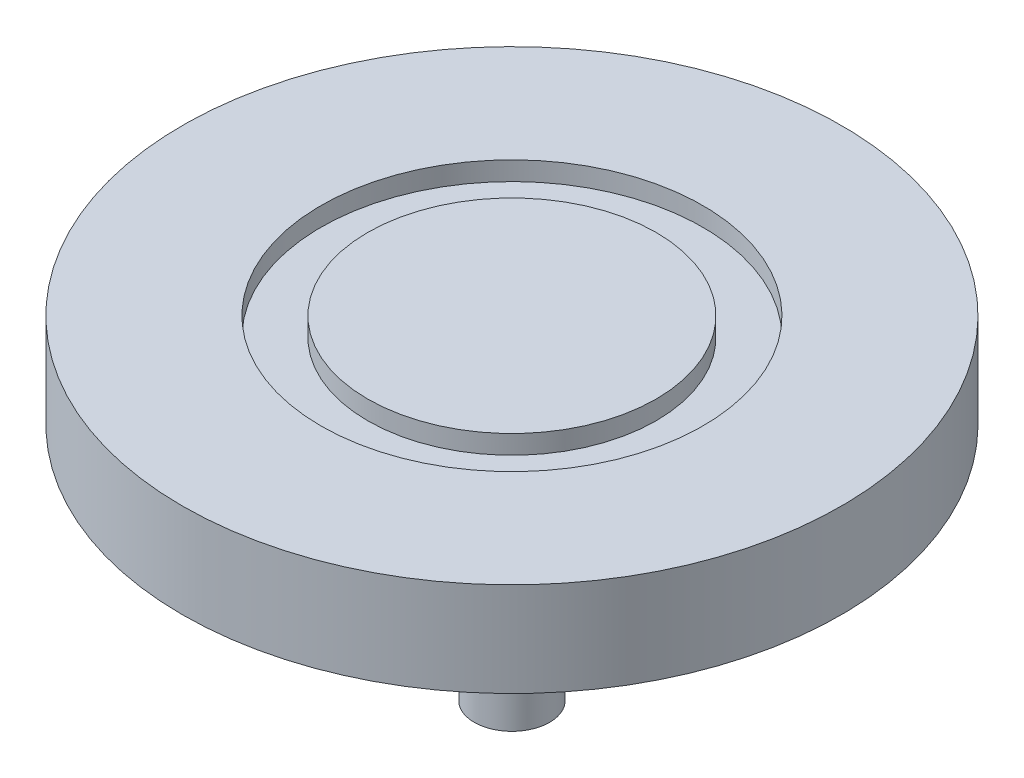
ISO-10303-21;
HEADER;
FILE_DESCRIPTION(('STEP AP214'),'2;1');
FILE_NAME('part.step','',(''),(''),'','','');
FILE_SCHEMA(('AUTOMOTIVE_DESIGN { 1 0 10303 214 1 1 1 1 }'));
ENDSEC;
DATA;
#1=APPLICATION_CONTEXT('core data for automotive mechanical design processes');
#2=APPLICATION_PROTOCOL_DEFINITION('international standard','automotive_design',2000,#1);
#3=PRODUCT_CONTEXT('',#1,'mechanical');
#4=PRODUCT('Part','Part','',(#3));
#5=PRODUCT_RELATED_PRODUCT_CATEGORY('part','',(#4));
#6=PRODUCT_DEFINITION_FORMATION('','',#4);
#7=PRODUCT_DEFINITION_CONTEXT('part definition',#1,'design');
#8=PRODUCT_DEFINITION('design','',#6,#7);
#9=PRODUCT_DEFINITION_SHAPE('','',#8);
#10=(LENGTH_UNIT() NAMED_UNIT(*) SI_UNIT(.MILLI.,.METRE.));
#11=(NAMED_UNIT(*) PLANE_ANGLE_UNIT() SI_UNIT($,.RADIAN.));
#12=(NAMED_UNIT(*) SI_UNIT($,.STERADIAN.) SOLID_ANGLE_UNIT());
#13=UNCERTAINTY_MEASURE_WITH_UNIT(LENGTH_MEASURE(1.E-05),#10,'distance_accuracy_value','');
#14=(GEOMETRIC_REPRESENTATION_CONTEXT(3) GLOBAL_UNCERTAINTY_ASSIGNED_CONTEXT((#13)) GLOBAL_UNIT_ASSIGNED_CONTEXT((#10,
#11,#12)) REPRESENTATION_CONTEXT('',''));
#15=CARTESIAN_POINT('',(0.,0.,0.));
#16=DIRECTION('',(0.,0.,1.));
#17=DIRECTION('',(1.,0.,0.));
#18=AXIS2_PLACEMENT_3D('',#15,#16,#17);
#19=CARTESIAN_POINT('',(0.,10.,0.));
#20=DIRECTION('',(0.,-1.,0.));
#21=DIRECTION('',(0.,0.,-1.));
#22=AXIS2_PLACEMENT_3D('',#19,#20,#21);
#23=CYLINDRICAL_SURFACE('',#22,35.);
#24=CARTESIAN_POINT('',(0.,10.,0.));
#25=DIRECTION('',(0.,1.,0.));
#26=DIRECTION('',(0.,0.,1.));
#27=AXIS2_PLACEMENT_3D('',#24,#25,#26);
#28=CIRCLE('',#27,35.);
#29=CARTESIAN_POINT('',(0.,10.,35.));
#30=VERTEX_POINT('',#29);
#31=EDGE_CURVE('E44',#30,#30,#28,.T.);
#32=ORIENTED_EDGE('',*,*,#31,.F.);
#33=EDGE_LOOP('',(#32));
#34=FACE_BOUND('',#33,.T.);
#35=CARTESIAN_POINT('',(0.,0.,0.));
#36=DIRECTION('',(0.,1.,0.));
#37=DIRECTION('',(0.,0.,1.));
#38=AXIS2_PLACEMENT_3D('',#35,#36,#37);
#39=CIRCLE('',#38,35.);
#40=CARTESIAN_POINT('',(0.,0.,35.));
#41=VERTEX_POINT('',#40);
#42=EDGE_CURVE('E49',#41,#41,#39,.T.);
#43=ORIENTED_EDGE('',*,*,#42,.T.);
#44=EDGE_LOOP('',(#43));
#45=FACE_BOUND('',#44,.T.);
#46=ADVANCED_FACE('F37',(#34,#45),#23,.T.);
#47=CARTESIAN_POINT('',(0.,10.,0.));
#48=DIRECTION('',(0.,1.,0.));
#49=DIRECTION('',(0.,0.,1.));
#50=AXIS2_PLACEMENT_3D('',#47,#48,#49);
#51=PLANE('',#50);
#52=CARTESIAN_POINT('',(0.,10.,0.));
#53=DIRECTION('',(0.,1.,0.));
#54=DIRECTION('',(0.,0.,1.));
#55=AXIS2_PLACEMENT_3D('',#52,#53,#54);
#56=CIRCLE('',#55,20.2802152454697);
#57=CARTESIAN_POINT('',(0.,10.,20.2802152454697));
#58=VERTEX_POINT('',#57);
#59=EDGE_CURVE('E57',#58,#58,#56,.T.);
#60=ORIENTED_EDGE('',*,*,#59,.F.);
#61=EDGE_LOOP('',(#60));
#62=FACE_BOUND('',#61,.T.);
#63=ORIENTED_EDGE('',*,*,#31,.T.);
#64=EDGE_LOOP('',(#63));
#65=FACE_BOUND('',#64,.T.);
#66=ADVANCED_FACE('F91',(#62,#65),#51,.T.);
#67=CARTESIAN_POINT('',(0.,0.,0.));
#68=DIRECTION('',(0.,1.,0.));
#69=DIRECTION('',(0.,0.,1.));
#70=AXIS2_PLACEMENT_3D('',#67,#68,#69);
#71=PLANE('',#70);
#72=CARTESIAN_POINT('',(0.,0.,0.));
#73=DIRECTION('',(0.,1.,0.));
#74=DIRECTION('',(0.,0.,1.));
#75=AXIS2_PLACEMENT_3D('',#72,#73,#74);
#76=CIRCLE('',#75,4.);
#77=CARTESIAN_POINT('',(0.,0.,4.));
#78=VERTEX_POINT('',#77);
#79=EDGE_CURVE('E10',#78,#78,#76,.F.);
#80=ORIENTED_EDGE('',*,*,#79,.F.);
#81=EDGE_LOOP('',(#80));
#82=FACE_BOUND('',#81,.T.);
#83=ORIENTED_EDGE('',*,*,#42,.F.);
#84=EDGE_LOOP('',(#83));
#85=FACE_BOUND('',#84,.T.);
#86=ADVANCED_FACE('F98',(#82,#85),#71,.F.);
#87=CARTESIAN_POINT('',(0.,8.,0.));
#88=DIRECTION('',(0.,1.,0.));
#89=DIRECTION('',(0.,0.,1.));
#90=AXIS2_PLACEMENT_3D('',#87,#88,#89);
#91=CYLINDRICAL_SURFACE('',#90,20.2802152454697);
#92=CARTESIAN_POINT('',(0.,8.,0.));
#93=DIRECTION('',(0.,1.,0.));
#94=DIRECTION('',(0.,0.,1.));
#95=AXIS2_PLACEMENT_3D('',#92,#93,#94);
#96=CIRCLE('',#95,20.2802152454697);
#97=CARTESIAN_POINT('',(0.,8.,20.2802152454697));
#98=VERTEX_POINT('',#97);
#99=EDGE_CURVE('E55',#98,#98,#96,.T.);
#100=ORIENTED_EDGE('',*,*,#99,.F.);
#101=EDGE_LOOP('',(#100));
#102=FACE_BOUND('',#101,.T.);
#103=ORIENTED_EDGE('',*,*,#59,.T.);
#104=EDGE_LOOP('',(#103));
#105=FACE_BOUND('',#104,.T.);
#106=ADVANCED_FACE('F104',(#102,#105),#91,.F.);
#107=CARTESIAN_POINT('',(0.,8.,0.));
#108=DIRECTION('',(0.,1.,0.));
#109=DIRECTION('',(0.,0.,1.));
#110=AXIS2_PLACEMENT_3D('',#107,#108,#109);
#111=PLANE('',#110);
#112=CARTESIAN_POINT('',(0.,8.,0.));
#113=DIRECTION('',(0.,1.,0.));
#114=DIRECTION('',(0.,0.,1.));
#115=AXIS2_PLACEMENT_3D('',#112,#113,#114);
#116=CIRCLE('',#115,15.3211625359088);
#117=CARTESIAN_POINT('',(0.,8.,15.3211625359088));
#118=VERTEX_POINT('',#117);
#119=EDGE_CURVE('E61',#118,#118,#116,.T.);
#120=ORIENTED_EDGE('',*,*,#119,.F.);
#121=EDGE_LOOP('',(#120));
#122=FACE_BOUND('',#121,.T.);
#123=ORIENTED_EDGE('',*,*,#99,.T.);
#124=EDGE_LOOP('',(#123));
#125=FACE_BOUND('',#124,.T.);
#126=ADVANCED_FACE('F110',(#122,#125),#111,.T.);
#127=CARTESIAN_POINT('',(0.,8.,0.));
#128=DIRECTION('',(0.,1.,0.));
#129=DIRECTION('',(0.,0.,1.));
#130=AXIS2_PLACEMENT_3D('',#127,#128,#129);
#131=CYLINDRICAL_SURFACE('',#130,15.3211625359088);
#132=ORIENTED_EDGE('',*,*,#119,.T.);
#133=EDGE_LOOP('',(#132));
#134=FACE_BOUND('',#133,.T.);
#135=CARTESIAN_POINT('',(0.,10.,0.));
#136=DIRECTION('',(0.,1.,0.));
#137=DIRECTION('',(0.,0.,1.));
#138=AXIS2_PLACEMENT_3D('',#135,#136,#137);
#139=CIRCLE('',#138,15.3211625359088);
#140=CARTESIAN_POINT('',(0.,10.,15.3211625359088));
#141=VERTEX_POINT('',#140);
#142=EDGE_CURVE('E65',#141,#141,#139,.T.);
#143=ORIENTED_EDGE('',*,*,#142,.F.);
#144=EDGE_LOOP('',(#143));
#145=FACE_BOUND('',#144,.T.);
#146=ADVANCED_FACE('F88',(#134,#145),#131,.T.);
#147=ORIENTED_EDGE('',*,*,#142,.T.);
#148=EDGE_LOOP('',(#147));
#149=FACE_BOUND('',#148,.T.);
#150=ADVANCED_FACE('F81',(#149),#51,.T.);
#151=CARTESIAN_POINT('',(0.,-25.4,0.));
#152=DIRECTION('',(0.,1.,0.));
#153=DIRECTION('',(0.,0.,1.));
#154=AXIS2_PLACEMENT_3D('',#151,#152,#153);
#155=CYLINDRICAL_SURFACE('',#154,4.);
#156=CARTESIAN_POINT('',(0.,-25.4,0.));
#157=DIRECTION('',(0.,-1.,0.));
#158=DIRECTION('',(0.,0.,-1.));
#159=AXIS2_PLACEMENT_3D('',#156,#157,#158);
#160=CIRCLE('',#159,4.);
#161=CARTESIAN_POINT('',(0.,-25.4,-4.));
#162=VERTEX_POINT('',#161);
#163=EDGE_CURVE('E69',#162,#162,#160,.T.);
#164=ORIENTED_EDGE('',*,*,#163,.F.);
#165=EDGE_LOOP('',(#164));
#166=FACE_BOUND('',#165,.T.);
#167=ORIENTED_EDGE('',*,*,#79,.T.);
#168=EDGE_LOOP('',(#167));
#169=FACE_BOUND('',#168,.T.);
#170=ADVANCED_FACE('F79',(#166,#169),#155,.T.);
#171=CARTESIAN_POINT('',(0.,-25.4,0.));
#172=DIRECTION('',(0.,-1.,0.));
#173=DIRECTION('',(0.,0.,-1.));
#174=AXIS2_PLACEMENT_3D('',#171,#172,#173);
#175=PLANE('',#174);
#176=ORIENTED_EDGE('',*,*,#163,.T.);
#177=EDGE_LOOP('',(#176));
#178=FACE_BOUND('',#177,.T.);
#179=ADVANCED_FACE('F77',(#178),#175,.T.);
#180=CLOSED_SHELL('',(#46,#66,#86,#106,#126,#146,#150,#170,#179));
#181=MANIFOLD_SOLID_BREP('B2',#180);
#182=ADVANCED_BREP_SHAPE_REPRESENTATION('',(#18,#181),#14);
#183=SHAPE_DEFINITION_REPRESENTATION(#9,#182);
ENDSEC;
END-ISO-10303-21;
